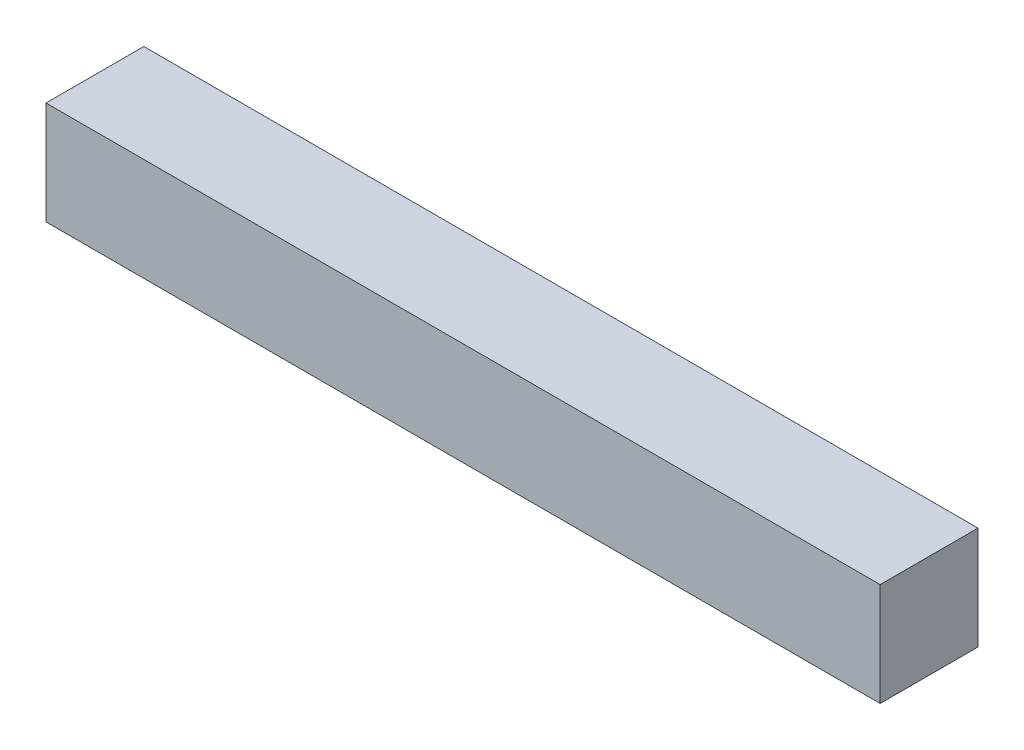
ISO-10303-21;
HEADER;
FILE_DESCRIPTION(('STEP AP214'),'2;1');
FILE_NAME('part.step','',(''),(''),'','','');
FILE_SCHEMA(('AUTOMOTIVE_DESIGN { 1 0 10303 214 1 1 1 1 }'));
ENDSEC;
DATA;
#1=APPLICATION_CONTEXT('core data for automotive mechanical design processes');
#2=APPLICATION_PROTOCOL_DEFINITION('international standard','automotive_design',2000,#1);
#3=PRODUCT_CONTEXT('',#1,'mechanical');
#4=PRODUCT('Part','Part','',(#3));
#5=PRODUCT_RELATED_PRODUCT_CATEGORY('part','',(#4));
#6=PRODUCT_DEFINITION_FORMATION('','',#4);
#7=PRODUCT_DEFINITION_CONTEXT('part definition',#1,'design');
#8=PRODUCT_DEFINITION('design','',#6,#7);
#9=PRODUCT_DEFINITION_SHAPE('','',#8);
#10=(LENGTH_UNIT() NAMED_UNIT(*) SI_UNIT(.MILLI.,.METRE.));
#11=(NAMED_UNIT(*) PLANE_ANGLE_UNIT() SI_UNIT($,.RADIAN.));
#12=(NAMED_UNIT(*) SI_UNIT($,.STERADIAN.) SOLID_ANGLE_UNIT());
#13=UNCERTAINTY_MEASURE_WITH_UNIT(LENGTH_MEASURE(1.E-05),#10,'distance_accuracy_value','');
#14=(GEOMETRIC_REPRESENTATION_CONTEXT(3) GLOBAL_UNCERTAINTY_ASSIGNED_CONTEXT((#13)) GLOBAL_UNIT_ASSIGNED_CONTEXT((#10,
#11,#12)) REPRESENTATION_CONTEXT('',''));
#15=CARTESIAN_POINT('',(0.,0.,0.));
#16=DIRECTION('',(0.,0.,1.));
#17=DIRECTION('',(1.,0.,0.));
#18=AXIS2_PLACEMENT_3D('',#15,#16,#17);
#19=CARTESIAN_POINT('',(0.,0.,4.75));
#20=DIRECTION('',(1.,0.,0.));
#21=DIRECTION('',(0.,0.,-1.));
#22=AXIS2_PLACEMENT_3D('',#19,#20,#21);
#23=PLANE('',#22);
#24=DIRECTION('',(0.,-1.,0.));
#25=VECTOR('',#24,1.);
#26=CARTESIAN_POINT('',(0.,0.,0.));
#27=LINE('',#26,#25);
#28=CARTESIAN_POINT('',(0.,5.,0.));
#29=VERTEX_POINT('',#28);
#30=CARTESIAN_POINT('',(0.,0.,0.));
#31=VERTEX_POINT('',#30);
#32=EDGE_CURVE('E118',#29,#31,#27,.T.);
#33=ORIENTED_EDGE('',*,*,#32,.T.);
#34=DIRECTION('',(0.,0.,-1.));
#35=VECTOR('',#34,1.);
#36=CARTESIAN_POINT('',(0.,0.,4.75));
#37=LINE('',#36,#35);
#38=CARTESIAN_POINT('',(0.,0.,4.75));
#39=VERTEX_POINT('',#38);
#40=EDGE_CURVE('E12',#39,#31,#37,.T.);
#41=ORIENTED_EDGE('',*,*,#40,.F.);
#42=DIRECTION('',(0.,-1.,0.));
#43=VECTOR('',#42,1.);
#44=CARTESIAN_POINT('',(0.,0.,4.75));
#45=LINE('',#44,#43);
#46=CARTESIAN_POINT('',(0.,5.,4.75));
#47=VERTEX_POINT('',#46);
#48=EDGE_CURVE('E87',#47,#39,#45,.T.);
#49=ORIENTED_EDGE('',*,*,#48,.F.);
#50=DIRECTION('',(0.,0.,-1.));
#51=VECTOR('',#50,1.);
#52=CARTESIAN_POINT('',(0.,5.,4.75));
#53=LINE('',#52,#51);
#54=EDGE_CURVE('E98',#47,#29,#53,.T.);
#55=ORIENTED_EDGE('',*,*,#54,.T.);
#56=EDGE_LOOP('',(#33,#41,#49,#55));
#57=FACE_BOUND('',#56,.T.);
#58=ADVANCED_FACE('F36',(#57),#23,.F.);
#59=CARTESIAN_POINT('',(0.,0.,4.75));
#60=DIRECTION('',(0.,1.,0.));
#61=DIRECTION('',(0.,0.,1.));
#62=AXIS2_PLACEMENT_3D('',#59,#60,#61);
#63=PLANE('',#62);
#64=DIRECTION('',(1.,0.,0.));
#65=VECTOR('',#64,1.);
#66=CARTESIAN_POINT('',(0.,0.,0.));
#67=LINE('',#66,#65);
#68=CARTESIAN_POINT('',(40.5,0.,0.));
#69=VERTEX_POINT('',#68);
#70=EDGE_CURVE('E92',#31,#69,#67,.T.);
#71=ORIENTED_EDGE('',*,*,#70,.T.);
#72=DIRECTION('',(0.,0.,-1.));
#73=VECTOR('',#72,1.);
#74=CARTESIAN_POINT('',(40.5,0.,4.75));
#75=LINE('',#74,#73);
#76=CARTESIAN_POINT('',(40.5,0.,4.75));
#77=VERTEX_POINT('',#76);
#78=EDGE_CURVE('E44',#77,#69,#75,.T.);
#79=ORIENTED_EDGE('',*,*,#78,.F.);
#80=DIRECTION('',(1.,0.,0.));
#81=VECTOR('',#80,1.);
#82=CARTESIAN_POINT('',(0.,0.,4.75));
#83=LINE('',#82,#81);
#84=EDGE_CURVE('E82',#39,#77,#83,.T.);
#85=ORIENTED_EDGE('',*,*,#84,.F.);
#86=ORIENTED_EDGE('',*,*,#40,.T.);
#87=EDGE_LOOP('',(#71,#79,#85,#86));
#88=FACE_BOUND('',#87,.T.);
#89=ADVANCED_FACE('F91',(#88),#63,.F.);
#90=CARTESIAN_POINT('',(40.5,0.,4.75));
#91=DIRECTION('',(-1.,0.,0.));
#92=DIRECTION('',(0.,0.,1.));
#93=AXIS2_PLACEMENT_3D('',#90,#91,#92);
#94=PLANE('',#93);
#95=DIRECTION('',(0.,1.,0.));
#96=VECTOR('',#95,1.);
#97=CARTESIAN_POINT('',(40.5,0.,0.));
#98=LINE('',#97,#96);
#99=CARTESIAN_POINT('',(40.5,5.,0.));
#100=VERTEX_POINT('',#99);
#101=EDGE_CURVE('E69',#69,#100,#98,.T.);
#102=ORIENTED_EDGE('',*,*,#101,.T.);
#103=DIRECTION('',(0.,0.,-1.));
#104=VECTOR('',#103,1.);
#105=CARTESIAN_POINT('',(40.5,5.,4.75));
#106=LINE('',#105,#104);
#107=CARTESIAN_POINT('',(40.5,5.,4.75));
#108=VERTEX_POINT('',#107);
#109=EDGE_CURVE('E93',#108,#100,#106,.T.);
#110=ORIENTED_EDGE('',*,*,#109,.F.);
#111=DIRECTION('',(0.,1.,0.));
#112=VECTOR('',#111,1.);
#113=CARTESIAN_POINT('',(40.5,0.,4.75));
#114=LINE('',#113,#112);
#115=EDGE_CURVE('E85',#77,#108,#114,.T.);
#116=ORIENTED_EDGE('',*,*,#115,.F.);
#117=ORIENTED_EDGE('',*,*,#78,.T.);
#118=EDGE_LOOP('',(#102,#110,#116,#117));
#119=FACE_BOUND('',#118,.T.);
#120=ADVANCED_FACE('F94',(#119),#94,.F.);
#121=CARTESIAN_POINT('',(0.,5.,4.75));
#122=DIRECTION('',(0.,-1.,0.));
#123=DIRECTION('',(0.,0.,-1.));
#124=AXIS2_PLACEMENT_3D('',#121,#122,#123);
#125=PLANE('',#124);
#126=DIRECTION('',(-1.,0.,0.));
#127=VECTOR('',#126,1.);
#128=CARTESIAN_POINT('',(0.,5.,0.));
#129=LINE('',#128,#127);
#130=EDGE_CURVE('E75',#100,#29,#129,.T.);
#131=ORIENTED_EDGE('',*,*,#130,.T.);
#132=ORIENTED_EDGE('',*,*,#54,.F.);
#133=DIRECTION('',(-1.,0.,0.));
#134=VECTOR('',#133,1.);
#135=CARTESIAN_POINT('',(0.,5.,4.75));
#136=LINE('',#135,#134);
#137=EDGE_CURVE('E52',#108,#47,#136,.T.);
#138=ORIENTED_EDGE('',*,*,#137,.F.);
#139=ORIENTED_EDGE('',*,*,#109,.T.);
#140=EDGE_LOOP('',(#131,#132,#138,#139));
#141=FACE_BOUND('',#140,.T.);
#142=ADVANCED_FACE('F113',(#141),#125,.F.);
#143=CARTESIAN_POINT('',(0.,0.,4.75));
#144=DIRECTION('',(0.,0.,-1.));
#145=DIRECTION('',(-1.,0.,0.));
#146=AXIS2_PLACEMENT_3D('',#143,#144,#145);
#147=PLANE('',#146);
#148=ORIENTED_EDGE('',*,*,#48,.T.);
#149=ORIENTED_EDGE('',*,*,#84,.T.);
#150=ORIENTED_EDGE('',*,*,#115,.T.);
#151=ORIENTED_EDGE('',*,*,#137,.T.);
#152=EDGE_LOOP('',(#148,#149,#150,#151));
#153=FACE_BOUND('',#152,.T.);
#154=ADVANCED_FACE('F83',(#153),#147,.F.);
#155=CARTESIAN_POINT('',(0.,0.,0.));
#156=DIRECTION('',(0.,0.,-1.));
#157=DIRECTION('',(-1.,0.,0.));
#158=AXIS2_PLACEMENT_3D('',#155,#156,#157);
#159=PLANE('',#158);
#160=ORIENTED_EDGE('',*,*,#32,.F.);
#161=ORIENTED_EDGE('',*,*,#130,.F.);
#162=ORIENTED_EDGE('',*,*,#101,.F.);
#163=ORIENTED_EDGE('',*,*,#70,.F.);
#164=EDGE_LOOP('',(#160,#161,#162,#163));
#165=FACE_BOUND('',#164,.T.);
#166=ADVANCED_FACE('F116',(#165),#159,.T.);
#167=CLOSED_SHELL('',(#58,#89,#120,#142,#154,#166));
#168=MANIFOLD_SOLID_BREP('B2',#167);
#169=ADVANCED_BREP_SHAPE_REPRESENTATION('',(#18,#168),#14);
#170=SHAPE_DEFINITION_REPRESENTATION(#9,#169);
ENDSEC;
END-ISO-10303-21;
